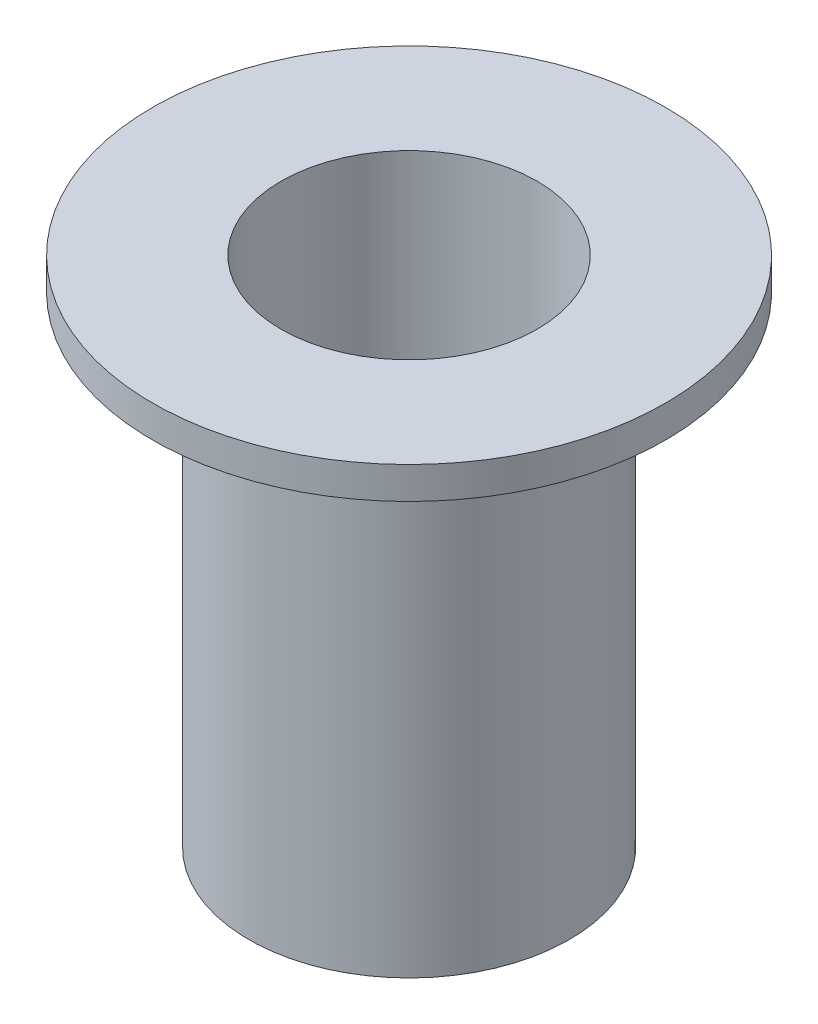
ISO-10303-21;
HEADER;
FILE_DESCRIPTION(('STEP AP214'),'2;1');
FILE_NAME('part.step','',(''),(''),'','','');
FILE_SCHEMA(('AUTOMOTIVE_DESIGN { 1 0 10303 214 1 1 1 1 }'));
ENDSEC;
DATA;
#1=APPLICATION_CONTEXT('core data for automotive mechanical design processes');
#2=APPLICATION_PROTOCOL_DEFINITION('international standard','automotive_design',2000,#1);
#3=PRODUCT_CONTEXT('',#1,'mechanical');
#4=PRODUCT('Part','Part','',(#3));
#5=PRODUCT_RELATED_PRODUCT_CATEGORY('part','',(#4));
#6=PRODUCT_DEFINITION_FORMATION('','',#4);
#7=PRODUCT_DEFINITION_CONTEXT('part definition',#1,'design');
#8=PRODUCT_DEFINITION('design','',#6,#7);
#9=PRODUCT_DEFINITION_SHAPE('','',#8);
#10=(LENGTH_UNIT() NAMED_UNIT(*) SI_UNIT(.MILLI.,.METRE.));
#11=(NAMED_UNIT(*) PLANE_ANGLE_UNIT() SI_UNIT($,.RADIAN.));
#12=(NAMED_UNIT(*) SI_UNIT($,.STERADIAN.) SOLID_ANGLE_UNIT());
#13=UNCERTAINTY_MEASURE_WITH_UNIT(LENGTH_MEASURE(1.E-05),#10,'distance_accuracy_value','');
#14=(GEOMETRIC_REPRESENTATION_CONTEXT(3) GLOBAL_UNCERTAINTY_ASSIGNED_CONTEXT((#13)) GLOBAL_UNIT_ASSIGNED_CONTEXT((#10,
#11,#12)) REPRESENTATION_CONTEXT('',''));
#15=CARTESIAN_POINT('',(0.,0.,0.));
#16=DIRECTION('',(0.,0.,1.));
#17=DIRECTION('',(1.,0.,0.));
#18=AXIS2_PLACEMENT_3D('',#15,#16,#17);
#19=CARTESIAN_POINT('',(0.,0.,-3.96875));
#20=DIRECTION('',(0.,-1.,0.));
#21=DIRECTION('',(0.,0.,-1.));
#22=AXIS2_PLACEMENT_3D('',#19,#20,#21);
#23=PLANE('',#22);
#24=CARTESIAN_POINT('',(0.,0.,0.));
#25=DIRECTION('',(0.,-1.,0.));
#26=DIRECTION('',(0.,0.,-1.));
#27=AXIS2_PLACEMENT_3D('',#24,#25,#26);
#28=CIRCLE('',#27,3.96875);
#29=CARTESIAN_POINT('',(0.,0.,-3.96875));
#30=VERTEX_POINT('',#29);
#31=EDGE_CURVE('E52',#30,#30,#28,.T.);
#32=ORIENTED_EDGE('',*,*,#31,.T.);
#33=EDGE_LOOP('',(#32));
#34=FACE_BOUND('',#33,.T.);
#35=CARTESIAN_POINT('',(0.,0.,0.));
#36=DIRECTION('',(0.,-1.,0.));
#37=DIRECTION('',(0.,0.,-1.));
#38=AXIS2_PLACEMENT_3D('',#35,#36,#37);
#39=CIRCLE('',#38,3.175);
#40=CARTESIAN_POINT('',(0.,0.,-3.175));
#41=VERTEX_POINT('',#40);
#42=EDGE_CURVE('E10',#41,#41,#39,.T.);
#43=ORIENTED_EDGE('',*,*,#42,.F.);
#44=EDGE_LOOP('',(#43));
#45=FACE_BOUND('',#44,.T.);
#46=ADVANCED_FACE('F30',(#34,#45),#23,.T.);
#47=CARTESIAN_POINT('',(0.,0.,0.));
#48=DIRECTION('',(0.,-1.,0.));
#49=DIRECTION('',(0.,0.,-1.));
#50=AXIS2_PLACEMENT_3D('',#47,#48,#49);
#51=CYLINDRICAL_SURFACE('',#50,3.175);
#52=ORIENTED_EDGE('',*,*,#42,.T.);
#53=EDGE_LOOP('',(#52));
#54=FACE_BOUND('',#53,.T.);
#55=CARTESIAN_POINT('',(0.,12.7,0.));
#56=DIRECTION('',(0.,-1.,0.));
#57=DIRECTION('',(0.,0.,-1.));
#58=AXIS2_PLACEMENT_3D('',#55,#56,#57);
#59=CIRCLE('',#58,3.175);
#60=CARTESIAN_POINT('',(0.,12.7,-3.175));
#61=VERTEX_POINT('',#60);
#62=EDGE_CURVE('E36',#61,#61,#59,.T.);
#63=ORIENTED_EDGE('',*,*,#62,.F.);
#64=EDGE_LOOP('',(#63));
#65=FACE_BOUND('',#64,.T.);
#66=ADVANCED_FACE('F70',(#54,#65),#51,.F.);
#67=CARTESIAN_POINT('',(0.,12.7,-3.175));
#68=DIRECTION('',(0.,1.,0.));
#69=DIRECTION('',(0.,0.,1.));
#70=AXIS2_PLACEMENT_3D('',#67,#68,#69);
#71=PLANE('',#70);
#72=ORIENTED_EDGE('',*,*,#62,.T.);
#73=EDGE_LOOP('',(#72));
#74=FACE_BOUND('',#73,.T.);
#75=CARTESIAN_POINT('',(0.,12.7,0.));
#76=DIRECTION('',(0.,-1.,0.));
#77=DIRECTION('',(0.,0.,-1.));
#78=AXIS2_PLACEMENT_3D('',#75,#76,#77);
#79=CIRCLE('',#78,6.35);
#80=CARTESIAN_POINT('',(0.,12.7,-6.35));
#81=VERTEX_POINT('',#80);
#82=EDGE_CURVE('E40',#81,#81,#79,.T.);
#83=ORIENTED_EDGE('',*,*,#82,.F.);
#84=EDGE_LOOP('',(#83));
#85=FACE_BOUND('',#84,.T.);
#86=ADVANCED_FACE('F74',(#74,#85),#71,.T.);
#87=CARTESIAN_POINT('',(0.,0.,0.));
#88=DIRECTION('',(0.,-1.,0.));
#89=DIRECTION('',(0.,0.,-1.));
#90=AXIS2_PLACEMENT_3D('',#87,#88,#89);
#91=CYLINDRICAL_SURFACE('',#90,6.35);
#92=ORIENTED_EDGE('',*,*,#82,.T.);
#93=EDGE_LOOP('',(#92));
#94=FACE_BOUND('',#93,.T.);
#95=CARTESIAN_POINT('',(0.,11.90625,0.));
#96=DIRECTION('',(0.,-1.,0.));
#97=DIRECTION('',(0.,0.,-1.));
#98=AXIS2_PLACEMENT_3D('',#95,#96,#97);
#99=CIRCLE('',#98,6.35);
#100=CARTESIAN_POINT('',(0.,11.90625,-6.35));
#101=VERTEX_POINT('',#100);
#102=EDGE_CURVE('E44',#101,#101,#99,.T.);
#103=ORIENTED_EDGE('',*,*,#102,.F.);
#104=EDGE_LOOP('',(#103));
#105=FACE_BOUND('',#104,.T.);
#106=ADVANCED_FACE('F66',(#94,#105),#91,.T.);
#107=CARTESIAN_POINT('',(0.,11.90625,-6.35));
#108=DIRECTION('',(0.,-1.,0.));
#109=DIRECTION('',(0.,0.,-1.));
#110=AXIS2_PLACEMENT_3D('',#107,#108,#109);
#111=PLANE('',#110);
#112=ORIENTED_EDGE('',*,*,#102,.T.);
#113=EDGE_LOOP('',(#112));
#114=FACE_BOUND('',#113,.T.);
#115=CARTESIAN_POINT('',(0.,11.90625,0.));
#116=DIRECTION('',(0.,-1.,0.));
#117=DIRECTION('',(0.,0.,-1.));
#118=AXIS2_PLACEMENT_3D('',#115,#116,#117);
#119=CIRCLE('',#118,3.96875);
#120=CARTESIAN_POINT('',(0.,11.90625,-3.96875));
#121=VERTEX_POINT('',#120);
#122=EDGE_CURVE('E49',#121,#121,#119,.T.);
#123=ORIENTED_EDGE('',*,*,#122,.F.);
#124=EDGE_LOOP('',(#123));
#125=FACE_BOUND('',#124,.T.);
#126=ADVANCED_FACE('F60',(#114,#125),#111,.T.);
#127=CARTESIAN_POINT('',(0.,0.,0.));
#128=DIRECTION('',(0.,-1.,0.));
#129=DIRECTION('',(0.,0.,-1.));
#130=AXIS2_PLACEMENT_3D('',#127,#128,#129);
#131=CYLINDRICAL_SURFACE('',#130,3.96875);
#132=ORIENTED_EDGE('',*,*,#122,.T.);
#133=EDGE_LOOP('',(#132));
#134=FACE_BOUND('',#133,.T.);
#135=ORIENTED_EDGE('',*,*,#31,.F.);
#136=EDGE_LOOP('',(#135));
#137=FACE_BOUND('',#136,.T.);
#138=ADVANCED_FACE('F58',(#134,#137),#131,.T.);
#139=CLOSED_SHELL('',(#46,#66,#86,#106,#126,#138));
#140=MANIFOLD_SOLID_BREP('B2',#139);
#141=ADVANCED_BREP_SHAPE_REPRESENTATION('',(#18,#140),#14);
#142=SHAPE_DEFINITION_REPRESENTATION(#9,#141);
ENDSEC;
END-ISO-10303-21;
